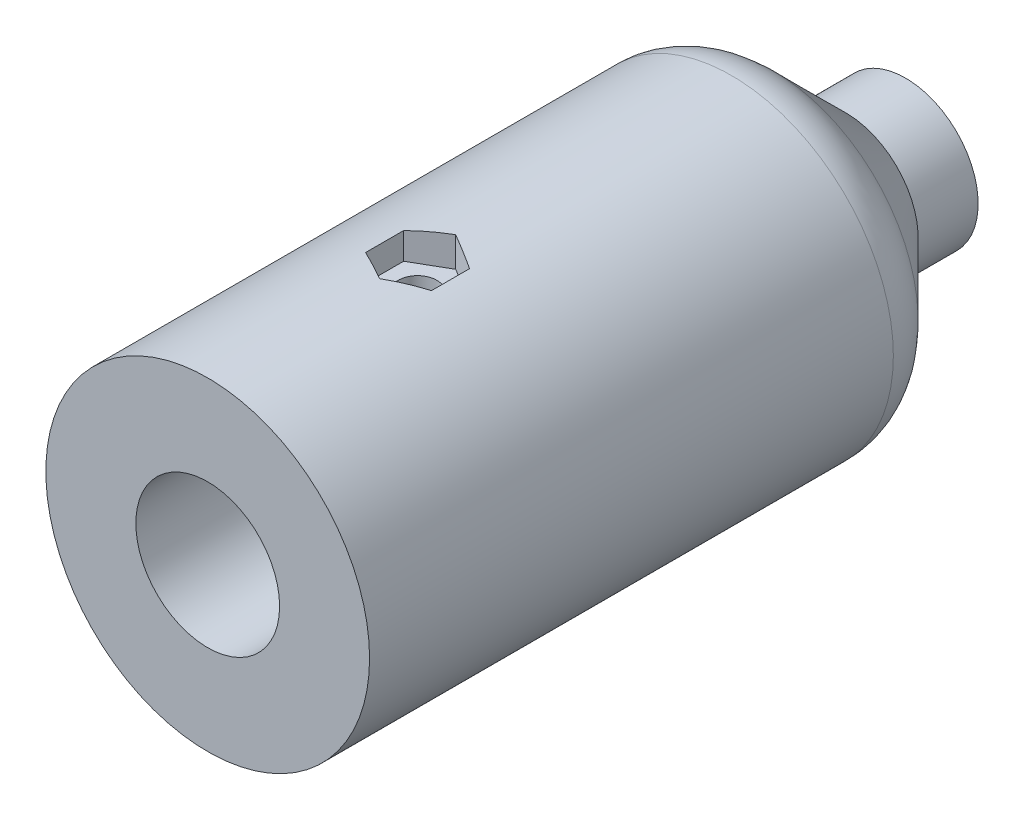
ISO-10303-21;
HEADER;
FILE_DESCRIPTION(('STEP AP214'),'2;1');
FILE_NAME('part.step','',(''),(''),'','','');
FILE_SCHEMA(('AUTOMOTIVE_DESIGN { 1 0 10303 214 1 1 1 1 }'));
ENDSEC;
DATA;
#1=APPLICATION_CONTEXT('core data for automotive mechanical design processes');
#2=APPLICATION_PROTOCOL_DEFINITION('international standard','automotive_design',2000,#1);
#3=PRODUCT_CONTEXT('',#1,'mechanical');
#4=PRODUCT('Part','Part','',(#3));
#5=PRODUCT_RELATED_PRODUCT_CATEGORY('part','',(#4));
#6=PRODUCT_DEFINITION_FORMATION('','',#4);
#7=PRODUCT_DEFINITION_CONTEXT('part definition',#1,'design');
#8=PRODUCT_DEFINITION('design','',#6,#7);
#9=PRODUCT_DEFINITION_SHAPE('','',#8);
#10=(LENGTH_UNIT() NAMED_UNIT(*) SI_UNIT(.MILLI.,.METRE.));
#11=(NAMED_UNIT(*) PLANE_ANGLE_UNIT() SI_UNIT($,.RADIAN.));
#12=(NAMED_UNIT(*) SI_UNIT($,.STERADIAN.) SOLID_ANGLE_UNIT());
#13=UNCERTAINTY_MEASURE_WITH_UNIT(LENGTH_MEASURE(1.E-05),#10,'distance_accuracy_value','');
#14=(GEOMETRIC_REPRESENTATION_CONTEXT(3) GLOBAL_UNCERTAINTY_ASSIGNED_CONTEXT((#13)) GLOBAL_UNIT_ASSIGNED_CONTEXT((#10,
#11,#12)) REPRESENTATION_CONTEXT('',''));
#15=CARTESIAN_POINT('',(0.,0.,0.));
#16=DIRECTION('',(0.,0.,1.));
#17=DIRECTION('',(1.,0.,0.));
#18=AXIS2_PLACEMENT_3D('',#15,#16,#17);
#19=CARTESIAN_POINT('',(0.,0.,-11.05));
#20=DIRECTION('',(0.,0.,1.));
#21=DIRECTION('',(1.,0.,0.));
#22=AXIS2_PLACEMENT_3D('',#19,#20,#21);
#23=CYLINDRICAL_SURFACE('',#22,13.5);
#24=CARTESIAN_POINT('',(0.,0.,4.52106781186549));
#25=DIRECTION('',(0.,0.,-1.));
#26=DIRECTION('',(-1.,0.,0.));
#27=AXIS2_PLACEMENT_3D('',#24,#25,#26);
#28=CIRCLE('',#27,13.5);
#29=CARTESIAN_POINT('',(-13.5,0.,4.52106781186549));
#30=VERTEX_POINT('',#29);
#31=EDGE_CURVE('E73',#30,#30,#28,.F.);
#32=ORIENTED_EDGE('',*,*,#31,.T.);
#33=EDGE_LOOP('',(#32));
#34=FACE_BOUND('',#33,.T.);
#35=CARTESIAN_POINT('',(0.,-13.5,33.45));
#36=CARTESIAN_POINT('',(-0.152776427921144,-13.4999971769599,33.4499944517676));
#37=CARTESIAN_POINT('',(-0.305622386157097,-13.4973800285345,33.4372257326495));
#38=CARTESIAN_POINT('',(-0.606989918720683,-13.4871922094026,33.3865311596364));
#39=CARTESIAN_POINT('',(-0.755508029342768,-13.4796176790417,33.3485857036456));
#40=CARTESIAN_POINT('',(-1.04381938705054,-13.4603604362313,33.2487617812005));
#41=CARTESIAN_POINT('',(-1.18362098312048,-13.4486817283599,33.1869066383386));
#42=CARTESIAN_POINT('',(-1.45085318025998,-13.4224839679877,33.0410894140454));
#43=CARTESIAN_POINT('',(-1.57828443705548,-13.4079650661628,32.9571285052713));
#44=CARTESIAN_POINT('',(-1.81895441528584,-13.3774558004972,32.7682352704008));
#45=CARTESIAN_POINT('',(-1.93199469903109,-13.3614492406223,32.6630527052597));
#46=CARTESIAN_POINT('',(-2.13895522160904,-13.3298858095393,32.4352397039523));
#47=CARTESIAN_POINT('',(-2.23287392848959,-13.3143289744471,32.3126078711494));
#48=CARTESIAN_POINT('',(-2.39977582887773,-13.2852679651617,32.0519423924096));
#49=CARTESIAN_POINT('',(-2.4725524437138,-13.2717846141375,31.9137739485517));
#50=CARTESIAN_POINT('',(-2.59378056474845,-13.2486277106913,31.6268497569824));
#51=CARTESIAN_POINT('',(-2.64223456933544,-13.2389537669935,31.4780950984669));
#52=CARTESIAN_POINT('',(-2.71279560040003,-13.2246750803094,31.1763595154767));
#53=CARTESIAN_POINT('',(-2.73525140615712,-13.2200032963911,31.0234633910747));
#54=CARTESIAN_POINT('',(-2.75426216373002,-13.2160561839857,30.7160079141797));
#55=CARTESIAN_POINT('',(-2.75081986524157,-13.2167802825982,30.5614487399987));
#56=CARTESIAN_POINT('',(-2.71841386837598,-13.2234822508663,30.2576140616789));
#57=CARTESIAN_POINT('',(-2.68985100745145,-13.2293776013332,30.1082937130338));
#58=CARTESIAN_POINT('',(-2.60864783385961,-13.2456277824189,29.8166096701382));
#59=CARTESIAN_POINT('',(-2.5560063326269,-13.2559828331753,29.6742463196817));
#60=CARTESIAN_POINT('',(-2.42776025922241,-13.2800694439878,29.3993677046943));
#61=CARTESIAN_POINT('',(-2.35199772147896,-13.2938241036426,29.2669282478996));
#62=CARTESIAN_POINT('',(-2.17977157653758,-13.323145427768,29.0164923722472));
#63=CARTESIAN_POINT('',(-2.08330550510322,-13.3387123078368,28.8984976753037));
#64=CARTESIAN_POINT('',(-1.87026911246385,-13.3702609169943,28.6779888001456));
#65=CARTESIAN_POINT('',(-1.75335691784843,-13.3862449636481,28.5758049558574));
#66=CARTESIAN_POINT('',(-1.50388066610741,-13.4165609216995,28.3924455790135));
#67=CARTESIAN_POINT('',(-1.37131639363404,-13.4308928103607,28.3112703355519));
#68=CARTESIAN_POINT('',(-1.09392514951882,-13.4563269065719,28.1721674318969));
#69=CARTESIAN_POINT('',(-0.949078187035954,-13.4674237133433,28.1142785864867));
#70=CARTESIAN_POINT('',(-0.65143817882934,-13.4850965282405,28.023749600173));
#71=CARTESIAN_POINT('',(-0.498646134925622,-13.4916731048566,27.9911062841818));
#72=CARTESIAN_POINT('',(-0.192290855098595,-13.4994849521774,27.9524650954842));
#73=CARTESIAN_POINT('',(-0.0387868584138547,-13.5008108012952,27.9460153172719));
#74=CARTESIAN_POINT('',(0.267105342411568,-13.4982238234868,27.9587257561482));
#75=CARTESIAN_POINT('',(0.419493611208024,-13.494311302576,27.9778844772379));
#76=CARTESIAN_POINT('',(0.717363197729971,-13.4817439728392,28.0408927474931));
#77=CARTESIAN_POINT('',(0.862895825974631,-13.4731339090149,28.0845094370501));
#78=CARTESIAN_POINT('',(1.14458145829174,-13.4521336840843,28.1949403040523));
#79=CARTESIAN_POINT('',(1.28073373932793,-13.4397432319848,28.2617562673032));
#80=CARTESIAN_POINT('',(1.5416925864592,-13.4123314152493,28.4176597330723));
#81=CARTESIAN_POINT('',(1.66633400590839,-13.3972787780333,28.5070180501576));
#82=CARTESIAN_POINT('',(1.89901500788807,-13.3662838850703,28.7051082159625));
#83=CARTESIAN_POINT('',(2.00705273658077,-13.3503415302547,28.8138422250973));
#84=CARTESIAN_POINT('',(2.20521187836328,-13.3190572268871,29.0496577337713));
#85=CARTESIAN_POINT('',(2.29502251850333,-13.3037287821263,29.1770024856556));
#86=CARTESIAN_POINT('',(2.45198046954391,-13.275698650571,29.4452353517825));
#87=CARTESIAN_POINT('',(2.51912870427313,-13.2629968567098,29.5861229136542));
#88=CARTESIAN_POINT('',(2.62843657934136,-13.2417682150959,29.8767213416989));
#89=CARTESIAN_POINT('',(2.67072822634444,-13.2332193550589,30.0263808686205));
#90=CARTESIAN_POINT('',(2.72952042949336,-13.2212191104971,30.3308754154677));
#91=CARTESIAN_POINT('',(2.74602449145786,-13.217767033069,30.4857097289579));
#92=CARTESIAN_POINT('',(2.75263951091989,-13.2163906866687,30.7930360469559));
#93=CARTESIAN_POINT('',(2.74324183991972,-13.2183635025496,30.9455172250479));
#94=CARTESIAN_POINT('',(2.6994073101927,-13.2273841762041,31.2466760776273));
#95=CARTESIAN_POINT('',(2.66497066952444,-13.2344319897808,31.3953537852265));
#96=CARTESIAN_POINT('',(2.57225848400871,-13.2527617255446,31.6843577756692));
#97=CARTESIAN_POINT('',(2.5140453536502,-13.2640325557458,31.8247048304222));
#98=CARTESIAN_POINT('',(2.37548994647098,-13.2895443138946,32.0937162125755));
#99=CARTESIAN_POINT('',(2.29514572606838,-13.3037855026763,32.2223795125727));
#100=CARTESIAN_POINT('',(2.11293981023068,-13.3339468270623,32.4668132410173));
#101=CARTESIAN_POINT('',(2.01072413518515,-13.3498921108282,32.5823167515072));
#102=CARTESIAN_POINT('',(1.78840516733545,-13.3814867636536,32.7946942547119));
#103=CARTESIAN_POINT('',(1.66829776668103,-13.3971360638246,32.8915639574644));
#104=CARTESIAN_POINT('',(1.41202612470544,-13.4265774434086,33.0649267555129));
#105=CARTESIAN_POINT('',(1.27570072821526,-13.4403473534443,33.141185557741));
#106=CARTESIAN_POINT('',(0.991925227527936,-13.4642595508069,33.2695900894426));
#107=CARTESIAN_POINT('',(0.84448515513844,-13.4744050630484,33.3217572673097));
#108=CARTESIAN_POINT('',(0.580622881074541,-13.4879848156679,33.3905471325646));
#109=CARTESIAN_POINT('',(0.465689330180749,-13.4924638514317,33.4128016861485));
#110=CARTESIAN_POINT('',(0.233850721641044,-13.4984724738658,33.4425299917581));
#111=CARTESIAN_POINT('',(0.116945731252775,-13.5000021609517,33.450004247004));
#112=CARTESIAN_POINT('',(0.,-13.5,33.45));
#113=B_SPLINE_CURVE_WITH_KNOTS('',3,(#35,#36,#37,#38,#39,#40,#41,#42,#43,#44,#45,#46,#47,#48,
#49,#50,#51,#52,#53,#54,#55,#56,#57,#58,#59,#60,#61,#62,#63,#64,#65,#66,#67,#68,#69,#70,#71,#72,
#73,#74,#75,#76,#77,#78,#79,#80,#81,#82,#83,#84,#85,#86,#87,#88,#89,#90,#91,#92,#93,#94,#95,#96,
#97,#98,#99,#100,#101,#102,#103,#104,#105,#106,#107,#108,#109,#110,#111,#112),.UNSPECIFIED.,.T.,
.F.,(4,2,2,2,2,2,2,2,2,2,2,2,2,2,2,2,2,2,2,2,2,2,2,2,2,2,2,2,2,2,2,2,2,2,2,2,2,2,4),(0.,
0.457901415191654,0.916159762127019,1.37397220747875,1.83176037187898,2.29530037440864,
2.75887749949944,3.22684259056603,3.69475960299622,4.15632374123228,4.61783887421981,
5.0721207709991,5.52642509437785,5.98390553179446,6.44144045101105,6.90752176557039,
7.3736094934164,7.84047092903916,8.3072736387298,8.76598768743038,9.22467494011729,
9.67906750733192,10.1334950599872,10.59366607949,11.0538884408084,11.5213979472355,
11.988888393423,12.4538731497629,12.9187946859866,13.3749573988852,13.8311161392162,
14.2860850580125,14.7410939455327,15.204114872189,15.6672422704403,16.1354317380176,
16.6032035765054,16.953725184125,17.3042348574426),.UNSPECIFIED.);
#114=CARTESIAN_POINT('',(0.,-13.5,33.45));
#115=VERTEX_POINT('',#114);
#116=EDGE_CURVE('E212',#115,#115,#113,.T.);
#117=ORIENTED_EDGE('',*,*,#116,.F.);
#118=EDGE_LOOP('',(#117));
#119=FACE_BOUND('',#118,.T.);
#120=DIRECTION('',(0.,0.,1.));
#121=VECTOR('',#120,1.);
#122=CARTESIAN_POINT('',(2.74999999999999,13.2169398878863,-11.05));
#123=LINE('',#122,#121);
#124=CARTESIAN_POINT('',(2.75,13.2169398878863,29.1122867597285));
#125=VERTEX_POINT('',#124);
#126=CARTESIAN_POINT('',(2.75,13.2169398878863,32.2877132402715));
#127=VERTEX_POINT('',#126);
#128=EDGE_CURVE('E206',#125,#127,#123,.T.);
#129=ORIENTED_EDGE('',*,*,#128,.T.);
#130=CARTESIAN_POINT('',(0.,0.,33.8754264805429));
#131=DIRECTION('',(-0.5,0.,-0.866025403784439));
#132=DIRECTION('',(-0.866025403784439,0.,0.5));
#133=AXIS2_PLACEMENT_3D('',#130,#131,#132);
#134=ELLIPSE('',#133,15.5884572681199,13.5);
#135=CARTESIAN_POINT('',(0.,13.5,33.8754264805429));
#136=VERTEX_POINT('',#135);
#137=EDGE_CURVE('E209',#127,#136,#134,.F.);
#138=ORIENTED_EDGE('',*,*,#137,.T.);
#139=CARTESIAN_POINT('',(0.,0.,33.8754264805429));
#140=DIRECTION('',(0.5,0.,-0.866025403784439));
#141=DIRECTION('',(0.866025403784439,0.,0.5));
#142=AXIS2_PLACEMENT_3D('',#139,#140,#141);
#143=ELLIPSE('',#142,15.5884572681199,13.5);
#144=CARTESIAN_POINT('',(-2.75,13.2169398878863,32.2877132402715));
#145=VERTEX_POINT('',#144);
#146=EDGE_CURVE('E200',#136,#145,#143,.F.);
#147=ORIENTED_EDGE('',*,*,#146,.T.);
#148=DIRECTION('',(0.,0.,1.));
#149=VECTOR('',#148,1.);
#150=CARTESIAN_POINT('',(-2.75,13.2169398878863,-11.05));
#151=LINE('',#150,#149);
#152=CARTESIAN_POINT('',(-2.75,13.2169398878863,29.1122867597285));
#153=VERTEX_POINT('',#152);
#154=EDGE_CURVE('E197',#145,#153,#151,.F.);
#155=ORIENTED_EDGE('',*,*,#154,.T.);
#156=CARTESIAN_POINT('',(0.,0.,27.524573519457));
#157=DIRECTION('',(0.499999999999999,0.,0.866025403784439));
#158=DIRECTION('',(-0.866025403784439,0.,0.499999999999999));
#159=AXIS2_PLACEMENT_3D('',#156,#157,#158);
#160=ELLIPSE('',#159,15.5884572681199,13.5);
#161=CARTESIAN_POINT('',(0.,13.5,27.5245735194571));
#162=VERTEX_POINT('',#161);
#163=EDGE_CURVE('E185',#153,#162,#160,.F.);
#164=ORIENTED_EDGE('',*,*,#163,.T.);
#165=CARTESIAN_POINT('',(0.,0.,27.5245735194571));
#166=DIRECTION('',(-0.5,0.,0.866025403784439));
#167=DIRECTION('',(0.866025403784439,0.,0.5));
#168=AXIS2_PLACEMENT_3D('',#165,#166,#167);
#169=ELLIPSE('',#168,15.5884572681199,13.5);
#170=EDGE_CURVE('E203',#162,#125,#169,.F.);
#171=ORIENTED_EDGE('',*,*,#170,.T.);
#172=EDGE_LOOP('',(#129,#138,#147,#155,#164,#171));
#173=FACE_BOUND('',#172,.T.);
#174=CARTESIAN_POINT('',(0.,0.,48.2));
#175=DIRECTION('',(0.,0.,1.));
#176=DIRECTION('',(1.,0.,0.));
#177=AXIS2_PLACEMENT_3D('',#174,#175,#176);
#178=CIRCLE('',#177,13.5);
#179=CARTESIAN_POINT('',(13.5,0.,48.2));
#180=VERTEX_POINT('',#179);
#181=EDGE_CURVE('E321',#180,#180,#178,.T.);
#182=ORIENTED_EDGE('',*,*,#181,.F.);
#183=EDGE_LOOP('',(#182));
#184=FACE_BOUND('',#183,.T.);
#185=ADVANCED_FACE('F65',(#34,#119,#173,#184),#23,.T.);
#186=CARTESIAN_POINT('',(0.,-13.5,30.7));
#187=DIRECTION('',(0.,1.,0.));
#188=DIRECTION('',(0.,0.,1.));
#189=AXIS2_PLACEMENT_3D('',#186,#187,#188);
#190=CYLINDRICAL_SURFACE('',#189,1.6);
#191=CARTESIAN_POINT('',(0.,5.995,32.3));
#192=CARTESIAN_POINT('',(0.0882009311312173,5.99499867317882,32.2999979121356));
#193=CARTESIAN_POINT('',(0.17642422822399,5.99303437544826,32.2926823602428));
#194=CARTESIAN_POINT('',(0.350329191213314,5.98538917892863,32.2636653458322));
#195=CARTESIAN_POINT('',(0.436009616316777,5.97970649593981,32.241956977116));
#196=CARTESIAN_POINT('',(0.602293459574496,5.96525171755918,32.1849105017096));
#197=CARTESIAN_POINT('',(0.68290327411591,5.95648361033672,32.1495899842784));
#198=CARTESIAN_POINT('',(0.837055008795305,5.93678451998636,32.0663870785984));
#199=CARTESIAN_POINT('',(0.91059645435456,5.92585339178114,32.0185038476779));
#200=CARTESIAN_POINT('',(1.05023162799301,5.90272452859954,31.9103608274746));
#201=CARTESIAN_POINT('',(1.11613783340779,5.89050511625252,31.8498635387372));
#202=CARTESIAN_POINT('',(1.23699980546535,5.86631602111606,31.7187173919366));
#203=CARTESIAN_POINT('',(1.29195415988865,5.85434637071087,31.6480672266991));
#204=CARTESIAN_POINT('',(1.39026728230258,5.83179025195281,31.4971234252965));
#205=CARTESIAN_POINT('',(1.43341023554609,5.82123113046806,31.4166847621637));
#206=CARTESIAN_POINT('',(1.50548578538349,5.80301035825185,31.2493682302588));
#207=CARTESIAN_POINT('',(1.5344210070937,5.79534817232325,31.1624915544342));
#208=CARTESIAN_POINT('',(1.57660831099613,5.78401263108547,30.9868420637415));
#209=CARTESIAN_POINT('',(1.59020041749614,5.78025294943169,30.89815662238));
#210=CARTESIAN_POINT('',(1.60237574331264,5.77689018820743,30.7196907062715));
#211=CARTESIAN_POINT('',(1.60096177211328,5.7772863305706,30.6299104396451));
#212=CARTESIAN_POINT('',(1.58343500745315,5.78211320182607,30.4544581223643));
#213=CARTESIAN_POINT('',(1.56773375096901,5.78643096428167,30.368741359081));
#214=CARTESIAN_POINT('',(1.52273728304157,5.798433679011,30.2012051557525));
#215=CARTESIAN_POINT('',(1.49344098351737,5.80611890079699,30.119386028233));
#216=CARTESIAN_POINT('',(1.42175089781012,5.82408988070221,29.9608953346289));
#217=CARTESIAN_POINT('',(1.37921290451351,5.83440403308756,29.884292353294));
#218=CARTESIAN_POINT('',(1.28234753170942,5.85645547525972,29.7391671755749));
#219=CARTESIAN_POINT('',(1.22801782801047,5.8681930454061,29.6706465763748));
#220=CARTESIAN_POINT('',(1.10700742359416,5.89223893913815,29.5412800528222));
#221=CARTESIAN_POINT('',(1.03998116386168,5.90455338050777,29.4807580487995));
#222=CARTESIAN_POINT('',(0.896580071928184,5.92802159624772,29.3717469894699));
#223=CARTESIAN_POINT('',(0.820204870253476,5.93917532471399,29.3232584099579));
#224=CARTESIAN_POINT('',(0.659771724709064,5.95913419077858,29.2395476572897));
#225=CARTESIAN_POINT('',(0.575681767093099,5.9679288873493,29.2043841866504));
#226=CARTESIAN_POINT('',(0.402495569505118,5.9821032927168,29.148786461377));
#227=CARTESIAN_POINT('',(0.313400429978754,5.98748374899899,29.1283489826238));
#228=CARTESIAN_POINT('',(0.135497286019495,5.99411036863877,29.103292179707));
#229=CARTESIAN_POINT('',(0.0467555006320438,5.99547160106602,29.0982324672473));
#230=CARTESIAN_POINT('',(-0.130308671227461,5.99423727230249,29.1028585206019));
#231=CARTESIAN_POINT('',(-0.218631100176095,5.99164212081684,29.1125427595995));
#232=CARTESIAN_POINT('',(-0.390777028997673,5.98286094666919,29.1460206336209));
#233=CARTESIAN_POINT('',(-0.474651797403314,5.97673749573674,29.1695685611624));
#234=CARTESIAN_POINT('',(-0.637252366454864,5.96159442848247,29.2298199793335));
#235=CARTESIAN_POINT('',(-0.715977607565144,5.95257449806308,29.2665248967723));
#236=CARTESIAN_POINT('',(-0.867755000663512,5.93236948427773,29.3528647521344));
#237=CARTESIAN_POINT('',(-0.940665602339168,5.92114540529718,29.4027391683202));
#238=CARTESIAN_POINT('',(-1.07723723889796,5.89782951335151,29.5137012643477));
#239=CARTESIAN_POINT('',(-1.14089643913312,5.88573752898016,29.5747911629131));
#240=CARTESIAN_POINT('',(-1.25901445940207,5.8616251914969,29.7085053277676));
#241=CARTESIAN_POINT('',(-1.31316255061806,5.84961651295647,29.7814066952659));
#242=CARTESIAN_POINT('',(-1.40846343798014,5.82740588066731,29.9355151787037));
#243=CARTESIAN_POINT('',(-1.44961677555626,5.81720385165181,30.0167219484097));
#244=CARTESIAN_POINT('',(-1.51745031159584,5.79987895113432,30.1847317613408));
#245=CARTESIAN_POINT('',(-1.54421421669802,5.79273832111226,30.271499077955));
#246=CARTESIAN_POINT('',(-1.58270658373837,5.78234121827934,30.4485256944194));
#247=CARTESIAN_POINT('',(-1.59443889583742,5.77908375085818,30.5387840939667));
#248=CARTESIAN_POINT('',(-1.60231331560927,5.77690497611476,30.7170492273819));
#249=CARTESIAN_POINT('',(-1.59895489297795,5.77784474334197,30.8050325305628));
#250=CARTESIAN_POINT('',(-1.57790198422086,5.78362922898375,30.9791293908038));
#251=CARTESIAN_POINT('',(-1.56020786817552,5.78847384659336,31.0652429960717));
#252=CARTESIAN_POINT('',(-1.51127563262582,5.80143940841345,31.2325261962096));
#253=CARTESIAN_POINT('',(-1.48014351584126,5.80953467643337,31.3137289281548));
#254=CARTESIAN_POINT('',(-1.40530135043208,5.82808999221794,31.4698201040866));
#255=CARTESIAN_POINT('',(-1.36158932580051,5.83855041143671,31.5447075536999));
#256=CARTESIAN_POINT('',(-1.26131509487244,5.86104249582564,31.6884260647396));
#257=CARTESIAN_POINT('',(-1.20441213224093,5.87311138322004,31.7570135810767));
#258=CARTESIAN_POINT('',(-1.08001912953457,5.89725283402995,31.8838286291276));
#259=CARTESIAN_POINT('',(-1.01252651784664,5.90932539762559,31.9420536370382));
#260=CARTESIAN_POINT('',(-0.867124141732705,5.93242343993464,32.0477179732475));
#261=CARTESIAN_POINT('',(-0.78902206810318,5.94342092178502,32.0948993096953));
#262=CARTESIAN_POINT('',(-0.625703962839209,5.96282325045673,32.1753881793273));
#263=CARTESIAN_POINT('',(-0.540492530242833,5.97122975710481,32.2087045994459));
#264=CARTESIAN_POINT('',(-0.379666973107866,5.98341812044031,32.2561810999783));
#265=CARTESIAN_POINT('',(-0.304744826990898,5.98772964751631,32.2725749799835));
#266=CARTESIAN_POINT('',(-0.153220634953612,5.9935210232652,32.2944847977789));
#267=CARTESIAN_POINT('',(-0.0766187562911916,5.99500115258861,32.3000018136948));
#268=CARTESIAN_POINT('',(0.,5.995,32.3));
#269=B_SPLINE_CURVE_WITH_KNOTS('',3,(#191,#192,#193,#194,#195,#196,#197,#198,#199,#200,#201,
#202,#203,#204,#205,#206,#207,#208,#209,#210,#211,#212,#213,#214,#215,#216,#217,#218,#219,#220,
#221,#222,#223,#224,#225,#226,#227,#228,#229,#230,#231,#232,#233,#234,#235,#236,#237,#238,#239,
#240,#241,#242,#243,#244,#245,#246,#247,#248,#249,#250,#251,#252,#253,#254,#255,#256,#257,#258,
#259,#260,#261,#262,#263,#264,#265,#266,#267,#268),.UNSPECIFIED.,.T.,.F.,(4,2,2,2,2,2,2,2,2,2,2,
2,2,2,2,2,2,2,2,2,2,2,2,2,2,2,2,2,2,2,2,2,2,2,2,2,2,2,4),(0.,0.264321809660573,0.52877054244699,
0.792878701138482,1.05700457999774,1.32664420530651,1.59631857764562,1.87063360801213,
2.14489793499314,2.41295693722292,2.68096575350503,2.94149097234365,3.2020370459466,
3.46552616630356,3.72906726862027,4.00121944473235,4.27338237987542,4.54673073733037,
4.82001922950163,5.08540383596019,5.35076096226274,5.6115509900175,5.8723693076979,
6.13830307871491,6.40428951537718,6.67779036103861,6.95127980970714,7.22316060410303,
7.49497174558827,7.75785403629649,8.02072954083199,8.2815682559654,8.54244796509492,
8.81101642239197,9.07965020066121,9.35404313079647,9.62825991260712,9.85789485813741,
10.0875070408784),.UNSPECIFIED.);
#270=CARTESIAN_POINT('',(0.,5.995,32.3));
#271=VERTEX_POINT('',#270);
#272=EDGE_CURVE('E193',#271,#271,#269,.T.);
#273=ORIENTED_EDGE('',*,*,#272,.F.);
#274=EDGE_LOOP('',(#273));
#275=FACE_BOUND('',#274,.T.);
#276=CARTESIAN_POINT('',(0.,11.,30.7));
#277=DIRECTION('',(0.,1.,0.));
#278=DIRECTION('',(0.,0.,1.));
#279=AXIS2_PLACEMENT_3D('',#276,#277,#278);
#280=CIRCLE('',#279,1.6);
#281=CARTESIAN_POINT('',(0.,11.,32.3));
#282=VERTEX_POINT('',#281);
#283=EDGE_CURVE('E190',#282,#282,#280,.F.);
#284=ORIENTED_EDGE('',*,*,#283,.F.);
#285=EDGE_LOOP('',(#284));
#286=FACE_BOUND('',#285,.T.);
#287=ADVANCED_FACE('F266',(#275,#286),#190,.F.);
#288=CARTESIAN_POINT('',(0.,0.,-15.));
#289=DIRECTION('',(0.,0.,1.));
#290=DIRECTION('',(1.,0.,0.));
#291=AXIS2_PLACEMENT_3D('',#288,#289,#290);
#292=CYLINDRICAL_SURFACE('',#291,6.05);
#293=CARTESIAN_POINT('',(0.,0.,-5.));
#294=DIRECTION('',(0.,0.,-1.));
#295=DIRECTION('',(-1.,0.,0.));
#296=AXIS2_PLACEMENT_3D('',#293,#294,#295);
#297=CIRCLE('',#296,6.05);
#298=CARTESIAN_POINT('',(-6.05,0.,-5.));
#299=VERTEX_POINT('',#298);
#300=EDGE_CURVE('E182',#299,#299,#297,.F.);
#301=ORIENTED_EDGE('',*,*,#300,.F.);
#302=EDGE_LOOP('',(#301));
#303=FACE_BOUND('',#302,.T.);
#304=CARTESIAN_POINT('',(0.,0.,-10.));
#305=DIRECTION('',(0.,0.,-1.));
#306=DIRECTION('',(-1.,0.,0.));
#307=AXIS2_PLACEMENT_3D('',#304,#305,#306);
#308=CIRCLE('',#307,6.05);
#309=CARTESIAN_POINT('',(-6.05,0.,-10.));
#310=VERTEX_POINT('',#309);
#311=EDGE_CURVE('E189',#310,#310,#308,.T.);
#312=ORIENTED_EDGE('',*,*,#311,.F.);
#313=EDGE_LOOP('',(#312));
#314=FACE_BOUND('',#313,.T.);
#315=ADVANCED_FACE('F291',(#303,#314),#292,.T.);
#316=CARTESIAN_POINT('',(0.,0.,38.2));
#317=DIRECTION('',(0.,0.,-1.));
#318=DIRECTION('',(-1.,0.,0.));
#319=AXIS2_PLACEMENT_3D('',#316,#317,#318);
#320=CYLINDRICAL_SURFACE('',#319,2.1);
#321=CARTESIAN_POINT('',(0.,0.,-10.));
#322=DIRECTION('',(0.,0.,-1.));
#323=DIRECTION('',(-1.,0.,0.));
#324=AXIS2_PLACEMENT_3D('',#321,#322,#323);
#325=CIRCLE('',#324,2.1);
#326=CARTESIAN_POINT('',(-2.1,0.,-10.));
#327=VERTEX_POINT('',#326);
#328=EDGE_CURVE('E178',#327,#327,#325,.F.);
#329=ORIENTED_EDGE('',*,*,#328,.F.);
#330=EDGE_LOOP('',(#329));
#331=FACE_BOUND('',#330,.T.);
#332=CARTESIAN_POINT('',(0.,0.,16.95));
#333=DIRECTION('',(0.,0.,1.));
#334=DIRECTION('',(1.,0.,0.));
#335=AXIS2_PLACEMENT_3D('',#332,#333,#334);
#336=CIRCLE('',#335,2.1);
#337=CARTESIAN_POINT('',(2.1,0.,16.95));
#338=VERTEX_POINT('',#337);
#339=EDGE_CURVE('E392',#338,#338,#336,.T.);
#340=ORIENTED_EDGE('',*,*,#339,.T.);
#341=EDGE_LOOP('',(#340));
#342=FACE_BOUND('',#341,.T.);
#343=ADVANCED_FACE('F294',(#331,#342),#320,.F.);
#344=CARTESIAN_POINT('',(0.,0.,-5.));
#345=DIRECTION('',(0.,0.,1.));
#346=DIRECTION('',(1.,0.,0.));
#347=AXIS2_PLACEMENT_3D('',#344,#345,#346);
#348=CONICAL_SURFACE('',#347,6.05000000000001,0.785398163397447);
#349=CARTESIAN_POINT('',(0.,0.,0.98553390593276));
#350=DIRECTION('',(0.,0.,-1.));
#351=DIRECTION('',(-1.,0.,0.));
#352=AXIS2_PLACEMENT_3D('',#349,#350,#351);
#353=CIRCLE('',#352,12.0355339059327);
#354=CARTESIAN_POINT('',(-12.0355339059327,0.,0.98553390593276));
#355=VERTEX_POINT('',#354);
#356=EDGE_CURVE('E12',#355,#355,#353,.T.);
#357=ORIENTED_EDGE('',*,*,#356,.T.);
#358=EDGE_LOOP('',(#357));
#359=FACE_BOUND('',#358,.T.);
#360=ORIENTED_EDGE('',*,*,#300,.T.);
#361=EDGE_LOOP('',(#360));
#362=FACE_BOUND('',#361,.T.);
#363=ADVANCED_FACE('F288',(#359,#362),#348,.T.);
#364=CARTESIAN_POINT('',(0.,0.,0.));
#365=DIRECTION('',(0.,0.,1.));
#366=DIRECTION('',(1.,0.,0.));
#367=AXIS2_PLACEMENT_3D('',#364,#365,#366);
#368=CYLINDRICAL_SURFACE('',#367,5.995);
#369=CARTESIAN_POINT('',(0.,0.,20.));
#370=DIRECTION('',(0.,0.,1.));
#371=DIRECTION('',(1.,0.,0.));
#372=AXIS2_PLACEMENT_3D('',#369,#370,#371);
#373=CIRCLE('',#372,5.995);
#374=CARTESIAN_POINT('',(5.995,0.,20.));
#375=VERTEX_POINT('',#374);
#376=EDGE_CURVE('E328',#375,#375,#373,.T.);
#377=ORIENTED_EDGE('',*,*,#376,.F.);
#378=EDGE_LOOP('',(#377));
#379=FACE_BOUND('',#378,.T.);
#380=CARTESIAN_POINT('',(0.,-5.995,32.3));
#381=CARTESIAN_POINT('',(-0.0882009311312173,-5.99499867317882,32.2999979121356));
#382=CARTESIAN_POINT('',(-0.17642422822399,-5.99303437544826,32.2926823602428));
#383=CARTESIAN_POINT('',(-0.350329191213314,-5.98538917892863,32.2636653458322));
#384=CARTESIAN_POINT('',(-0.436009616316777,-5.97970649593981,32.241956977116));
#385=CARTESIAN_POINT('',(-0.602293459574496,-5.96525171755918,32.1849105017096));
#386=CARTESIAN_POINT('',(-0.68290327411591,-5.95648361033672,32.1495899842784));
#387=CARTESIAN_POINT('',(-0.837055008795305,-5.93678451998636,32.0663870785984));
#388=CARTESIAN_POINT('',(-0.91059645435456,-5.92585339178114,32.0185038476779));
#389=CARTESIAN_POINT('',(-1.05023162799301,-5.90272452859954,31.9103608274746));
#390=CARTESIAN_POINT('',(-1.11613783340779,-5.89050511625252,31.8498635387372));
#391=CARTESIAN_POINT('',(-1.23699980546535,-5.86631602111606,31.7187173919366));
#392=CARTESIAN_POINT('',(-1.29195415988865,-5.85434637071087,31.6480672266991));
#393=CARTESIAN_POINT('',(-1.39026728230258,-5.83179025195281,31.4971234252965));
#394=CARTESIAN_POINT('',(-1.43341023554609,-5.82123113046806,31.4166847621637));
#395=CARTESIAN_POINT('',(-1.50548578538349,-5.80301035825185,31.2493682302588));
#396=CARTESIAN_POINT('',(-1.5344210070937,-5.79534817232325,31.1624915544342));
#397=CARTESIAN_POINT('',(-1.57660831099613,-5.78401263108547,30.9868420637415));
#398=CARTESIAN_POINT('',(-1.59020041749614,-5.78025294943169,30.89815662238));
#399=CARTESIAN_POINT('',(-1.60237574331264,-5.77689018820743,30.7196907062715));
#400=CARTESIAN_POINT('',(-1.60096177211328,-5.7772863305706,30.6299104396451));
#401=CARTESIAN_POINT('',(-1.58343500745315,-5.78211320182607,30.4544581223643));
#402=CARTESIAN_POINT('',(-1.56773375096901,-5.78643096428167,30.368741359081));
#403=CARTESIAN_POINT('',(-1.52273728304157,-5.798433679011,30.2012051557525));
#404=CARTESIAN_POINT('',(-1.49344098351737,-5.80611890079699,30.119386028233));
#405=CARTESIAN_POINT('',(-1.42175089781012,-5.82408988070221,29.9608953346289));
#406=CARTESIAN_POINT('',(-1.37921290451351,-5.83440403308756,29.884292353294));
#407=CARTESIAN_POINT('',(-1.28234753170942,-5.85645547525972,29.7391671755749));
#408=CARTESIAN_POINT('',(-1.22801782801047,-5.8681930454061,29.6706465763748));
#409=CARTESIAN_POINT('',(-1.10700742359416,-5.89223893913815,29.5412800528222));
#410=CARTESIAN_POINT('',(-1.03998116386168,-5.90455338050777,29.4807580487995));
#411=CARTESIAN_POINT('',(-0.896580071928184,-5.92802159624772,29.3717469894699));
#412=CARTESIAN_POINT('',(-0.820204870253476,-5.93917532471399,29.3232584099579));
#413=CARTESIAN_POINT('',(-0.659771724709064,-5.95913419077858,29.2395476572897));
#414=CARTESIAN_POINT('',(-0.575681767093099,-5.9679288873493,29.2043841866504));
#415=CARTESIAN_POINT('',(-0.402495569505118,-5.9821032927168,29.148786461377));
#416=CARTESIAN_POINT('',(-0.313400429978754,-5.98748374899899,29.1283489826238));
#417=CARTESIAN_POINT('',(-0.135497286019495,-5.99411036863877,29.103292179707));
#418=CARTESIAN_POINT('',(-0.0467555006320438,-5.99547160106602,29.0982324672473));
#419=CARTESIAN_POINT('',(0.130308671227461,-5.99423727230249,29.1028585206019));
#420=CARTESIAN_POINT('',(0.218631100176095,-5.99164212081684,29.1125427595995));
#421=CARTESIAN_POINT('',(0.390777028997673,-5.98286094666919,29.1460206336209));
#422=CARTESIAN_POINT('',(0.474651797403314,-5.97673749573674,29.1695685611624));
#423=CARTESIAN_POINT('',(0.637252366454864,-5.96159442848247,29.2298199793335));
#424=CARTESIAN_POINT('',(0.715977607565144,-5.95257449806308,29.2665248967723));
#425=CARTESIAN_POINT('',(0.867755000663512,-5.93236948427773,29.3528647521344));
#426=CARTESIAN_POINT('',(0.940665602339168,-5.92114540529718,29.4027391683202));
#427=CARTESIAN_POINT('',(1.07723723889796,-5.89782951335151,29.5137012643477));
#428=CARTESIAN_POINT('',(1.14089643913312,-5.88573752898016,29.5747911629131));
#429=CARTESIAN_POINT('',(1.25901445940207,-5.8616251914969,29.7085053277676));
#430=CARTESIAN_POINT('',(1.31316255061806,-5.84961651295647,29.7814066952659));
#431=CARTESIAN_POINT('',(1.40846343798014,-5.82740588066731,29.9355151787037));
#432=CARTESIAN_POINT('',(1.44961677555626,-5.81720385165181,30.0167219484097));
#433=CARTESIAN_POINT('',(1.51745031159584,-5.79987895113432,30.1847317613408));
#434=CARTESIAN_POINT('',(1.54421421669802,-5.79273832111226,30.271499077955));
#435=CARTESIAN_POINT('',(1.58270658373837,-5.78234121827934,30.4485256944194));
#436=CARTESIAN_POINT('',(1.59443889583742,-5.77908375085818,30.5387840939667));
#437=CARTESIAN_POINT('',(1.60231331560927,-5.77690497611476,30.7170492273819));
#438=CARTESIAN_POINT('',(1.59895489297795,-5.77784474334197,30.8050325305628));
#439=CARTESIAN_POINT('',(1.57790198422086,-5.78362922898375,30.9791293908038));
#440=CARTESIAN_POINT('',(1.56020786817552,-5.78847384659336,31.0652429960717));
#441=CARTESIAN_POINT('',(1.51127563262582,-5.80143940841345,31.2325261962096));
#442=CARTESIAN_POINT('',(1.48014351584126,-5.80953467643337,31.3137289281548));
#443=CARTESIAN_POINT('',(1.40530135043208,-5.82808999221794,31.4698201040866));
#444=CARTESIAN_POINT('',(1.36158932580051,-5.83855041143671,31.5447075536999));
#445=CARTESIAN_POINT('',(1.26131509487244,-5.86104249582564,31.6884260647396));
#446=CARTESIAN_POINT('',(1.20441213224093,-5.87311138322004,31.7570135810767));
#447=CARTESIAN_POINT('',(1.08001912953457,-5.89725283402995,31.8838286291276));
#448=CARTESIAN_POINT('',(1.01252651784664,-5.90932539762559,31.9420536370382));
#449=CARTESIAN_POINT('',(0.867124141732705,-5.93242343993464,32.0477179732475));
#450=CARTESIAN_POINT('',(0.78902206810318,-5.94342092178502,32.0948993096953));
#451=CARTESIAN_POINT('',(0.625703962839209,-5.96282325045673,32.1753881793273));
#452=CARTESIAN_POINT('',(0.540492530242833,-5.97122975710481,32.2087045994459));
#453=CARTESIAN_POINT('',(0.379666973107866,-5.98341812044031,32.2561810999783));
#454=CARTESIAN_POINT('',(0.304744826990898,-5.98772964751631,32.2725749799835));
#455=CARTESIAN_POINT('',(0.153220634953612,-5.9935210232652,32.2944847977789));
#456=CARTESIAN_POINT('',(0.0766187562911916,-5.99500115258861,32.3000018136948));
#457=CARTESIAN_POINT('',(0.,-5.995,32.3));
#458=B_SPLINE_CURVE_WITH_KNOTS('',3,(#380,#381,#382,#383,#384,#385,#386,#387,#388,#389,#390,
#391,#392,#393,#394,#395,#396,#397,#398,#399,#400,#401,#402,#403,#404,#405,#406,#407,#408,#409,
#410,#411,#412,#413,#414,#415,#416,#417,#418,#419,#420,#421,#422,#423,#424,#425,#426,#427,#428,
#429,#430,#431,#432,#433,#434,#435,#436,#437,#438,#439,#440,#441,#442,#443,#444,#445,#446,#447,
#448,#449,#450,#451,#452,#453,#454,#455,#456,#457),.UNSPECIFIED.,.T.,.F.,(4,2,2,2,2,2,2,2,2,2,2,
2,2,2,2,2,2,2,2,2,2,2,2,2,2,2,2,2,2,2,2,2,2,2,2,2,2,2,4),(0.,0.264321809660573,0.52877054244699,
0.792878701138482,1.05700457999774,1.32664420530651,1.59631857764562,1.87063360801213,
2.14489793499314,2.41295693722292,2.68096575350503,2.94149097234365,3.2020370459466,
3.46552616630356,3.72906726862027,4.00121944473235,4.27338237987542,4.54673073733037,
4.82001922950163,5.08540383596019,5.35076096226274,5.6115509900175,5.8723693076979,
6.13830307871491,6.40428951537718,6.67779036103861,6.95127980970714,7.22316060410303,
7.49497174558827,7.75785403629649,8.02072954083199,8.2815682559654,8.54244796509492,
8.81101642239197,9.07965020066121,9.35404313079647,9.62825991260712,9.85789485813741,
10.0875070408784),.UNSPECIFIED.);
#459=CARTESIAN_POINT('',(0.,-5.995,32.3));
#460=VERTEX_POINT('',#459);
#461=EDGE_CURVE('E269',#460,#460,#458,.T.);
#462=ORIENTED_EDGE('',*,*,#461,.T.);
#463=EDGE_LOOP('',(#462));
#464=FACE_BOUND('',#463,.T.);
#465=ORIENTED_EDGE('',*,*,#272,.T.);
#466=EDGE_LOOP('',(#465));
#467=FACE_BOUND('',#466,.T.);
#468=CARTESIAN_POINT('',(0.,0.,48.2));
#469=DIRECTION('',(0.,0.,1.));
#470=DIRECTION('',(1.,0.,0.));
#471=AXIS2_PLACEMENT_3D('',#468,#469,#470);
#472=CIRCLE('',#471,5.995);
#473=CARTESIAN_POINT('',(5.995,0.,48.2));
#474=VERTEX_POINT('',#473);
#475=EDGE_CURVE('E323',#474,#474,#472,.T.);
#476=ORIENTED_EDGE('',*,*,#475,.T.);
#477=EDGE_LOOP('',(#476));
#478=FACE_BOUND('',#477,.T.);
#479=ADVANCED_FACE('F282',(#379,#464,#467,#478),#368,.F.);
#480=CARTESIAN_POINT('',(3.5,2.02072594216369,15.7));
#481=DIRECTION('',(0.5,0.866025403784439,0.));
#482=DIRECTION('',(-0.866025403784439,0.5,0.));
#483=AXIS2_PLACEMENT_3D('',#480,#481,#482);
#484=PLANE('',#483);
#485=DIRECTION('',(0.,0.,1.));
#486=VECTOR('',#485,1.);
#487=CARTESIAN_POINT('',(0.,4.04145188432738,15.7));
#488=LINE('',#487,#486);
#489=CARTESIAN_POINT('',(0.,4.04145188432738,16.95));
#490=VERTEX_POINT('',#489);
#491=CARTESIAN_POINT('',(0.,4.04145188432738,20.));
#492=VERTEX_POINT('',#491);
#493=EDGE_CURVE('E174',#490,#492,#488,.T.);
#494=ORIENTED_EDGE('',*,*,#493,.F.);
#495=DIRECTION('',(-0.866025403784441,0.499999999999995,0.));
#496=VECTOR('',#495,1.);
#497=CARTESIAN_POINT('',(3.49999999999998,2.02072594216373,16.95));
#498=LINE('',#497,#496);
#499=CARTESIAN_POINT('',(3.49999999999998,2.02072594216373,16.95));
#500=VERTEX_POINT('',#499);
#501=EDGE_CURVE('E80',#500,#490,#498,.T.);
#502=ORIENTED_EDGE('',*,*,#501,.F.);
#503=DIRECTION('',(0.,0.,1.));
#504=VECTOR('',#503,1.);
#505=CARTESIAN_POINT('',(3.5,2.02072594216369,15.7));
#506=LINE('',#505,#504);
#507=CARTESIAN_POINT('',(3.49999999999998,2.02072594216373,20.));
#508=VERTEX_POINT('',#507);
#509=EDGE_CURVE('E186',#500,#508,#506,.T.);
#510=ORIENTED_EDGE('',*,*,#509,.T.);
#511=DIRECTION('',(-0.866025403784441,0.499999999999995,0.));
#512=VECTOR('',#511,1.);
#513=CARTESIAN_POINT('',(3.49999999999998,2.02072594216373,20.));
#514=LINE('',#513,#512);
#515=EDGE_CURVE('E383',#508,#492,#514,.T.);
#516=ORIENTED_EDGE('',*,*,#515,.T.);
#517=EDGE_LOOP('',(#494,#502,#510,#516));
#518=FACE_BOUND('',#517,.T.);
#519=ADVANCED_FACE('F287',(#518),#484,.F.);
#520=CARTESIAN_POINT('',(3.5,-2.02072594216369,15.7));
#521=DIRECTION('',(1.,0.,0.));
#522=DIRECTION('',(0.,1.,0.));
#523=AXIS2_PLACEMENT_3D('',#520,#521,#522);
#524=PLANE('',#523);
#525=ORIENTED_EDGE('',*,*,#509,.F.);
#526=DIRECTION('',(0.,1.,0.));
#527=VECTOR('',#526,1.);
#528=CARTESIAN_POINT('',(3.50000000000002,-2.02072594216366,16.95));
#529=LINE('',#528,#527);
#530=CARTESIAN_POINT('',(3.50000000000002,-2.02072594216366,16.95));
#531=VERTEX_POINT('',#530);
#532=EDGE_CURVE('E386',#531,#500,#529,.T.);
#533=ORIENTED_EDGE('',*,*,#532,.F.);
#534=DIRECTION('',(0.,0.,1.));
#535=VECTOR('',#534,1.);
#536=CARTESIAN_POINT('',(3.5,-2.02072594216369,15.7));
#537=LINE('',#536,#535);
#538=CARTESIAN_POINT('',(3.50000000000002,-2.02072594216366,20.));
#539=VERTEX_POINT('',#538);
#540=EDGE_CURVE('E636',#531,#539,#537,.T.);
#541=ORIENTED_EDGE('',*,*,#540,.T.);
#542=DIRECTION('',(0.,1.,0.));
#543=VECTOR('',#542,1.);
#544=CARTESIAN_POINT('',(3.50000000000002,-2.02072594216366,20.));
#545=LINE('',#544,#543);
#546=EDGE_CURVE('E371',#539,#508,#545,.T.);
#547=ORIENTED_EDGE('',*,*,#546,.T.);
#548=EDGE_LOOP('',(#525,#533,#541,#547));
#549=FACE_BOUND('',#548,.T.);
#550=ADVANCED_FACE('F493',(#549),#524,.F.);
#551=CARTESIAN_POINT('',(0.,-4.04145188432738,15.7));
#552=DIRECTION('',(0.5,-0.866025403784439,0.));
#553=DIRECTION('',(0.866025403784439,0.5,0.));
#554=AXIS2_PLACEMENT_3D('',#551,#552,#553);
#555=PLANE('',#554);
#556=ORIENTED_EDGE('',*,*,#540,.F.);
#557=DIRECTION('',(0.866025403784435,0.500000000000007,0.));
#558=VECTOR('',#557,1.);
#559=CARTESIAN_POINT('',(0.,-4.04145188432738,16.95));
#560=LINE('',#559,#558);
#561=CARTESIAN_POINT('',(0.,-4.04145188432738,16.95));
#562=VERTEX_POINT('',#561);
#563=EDGE_CURVE('E388',#562,#531,#560,.T.);
#564=ORIENTED_EDGE('',*,*,#563,.F.);
#565=DIRECTION('',(0.,0.,1.));
#566=VECTOR('',#565,1.);
#567=CARTESIAN_POINT('',(0.,-4.04145188432738,15.7));
#568=LINE('',#567,#566);
#569=CARTESIAN_POINT('',(0.,-4.04145188432738,20.));
#570=VERTEX_POINT('',#569);
#571=EDGE_CURVE('E176',#562,#570,#568,.T.);
#572=ORIENTED_EDGE('',*,*,#571,.T.);
#573=DIRECTION('',(0.866025403784435,0.500000000000007,0.));
#574=VECTOR('',#573,1.);
#575=CARTESIAN_POINT('',(0.,-4.04145188432738,20.));
#576=LINE('',#575,#574);
#577=EDGE_CURVE('E374',#570,#539,#576,.T.);
#578=ORIENTED_EDGE('',*,*,#577,.T.);
#579=EDGE_LOOP('',(#556,#564,#572,#578));
#580=FACE_BOUND('',#579,.T.);
#581=ADVANCED_FACE('F485',(#580),#555,.F.);
#582=CARTESIAN_POINT('',(-3.5,-2.02072594216369,15.7));
#583=DIRECTION('',(-0.5,-0.866025403784439,0.));
#584=DIRECTION('',(0.866025403784439,-0.5,0.));
#585=AXIS2_PLACEMENT_3D('',#582,#583,#584);
#586=PLANE('',#585);
#587=ORIENTED_EDGE('',*,*,#571,.F.);
#588=DIRECTION('',(0.866025403784441,-0.499999999999995,0.));
#589=VECTOR('',#588,1.);
#590=CARTESIAN_POINT('',(-3.49999999999999,-2.02072594216371,16.95));
#591=LINE('',#590,#589);
#592=CARTESIAN_POINT('',(-3.49999999999999,-2.02072594216371,16.95));
#593=VERTEX_POINT('',#592);
#594=EDGE_CURVE('E168',#593,#562,#591,.T.);
#595=ORIENTED_EDGE('',*,*,#594,.F.);
#596=DIRECTION('',(0.,0.,1.));
#597=VECTOR('',#596,1.);
#598=CARTESIAN_POINT('',(-3.5,-2.02072594216369,15.7));
#599=LINE('',#598,#597);
#600=CARTESIAN_POINT('',(-3.49999999999999,-2.02072594216371,20.));
#601=VERTEX_POINT('',#600);
#602=EDGE_CURVE('E167',#593,#601,#599,.T.);
#603=ORIENTED_EDGE('',*,*,#602,.T.);
#604=DIRECTION('',(0.866025403784441,-0.499999999999995,0.));
#605=VECTOR('',#604,1.);
#606=CARTESIAN_POINT('',(-3.49999999999999,-2.02072594216371,20.));
#607=LINE('',#606,#605);
#608=EDGE_CURVE('E377',#601,#570,#607,.T.);
#609=ORIENTED_EDGE('',*,*,#608,.T.);
#610=EDGE_LOOP('',(#587,#595,#603,#609));
#611=FACE_BOUND('',#610,.T.);
#612=ADVANCED_FACE('F478',(#611),#586,.F.);
#613=CARTESIAN_POINT('',(-3.5,2.02072594216369,15.7));
#614=DIRECTION('',(-1.,0.,0.));
#615=DIRECTION('',(0.,-1.,0.));
#616=AXIS2_PLACEMENT_3D('',#613,#614,#615);
#617=PLANE('',#616);
#618=ORIENTED_EDGE('',*,*,#602,.F.);
#619=DIRECTION('',(0.,-1.,0.));
#620=VECTOR('',#619,1.);
#621=CARTESIAN_POINT('',(-3.50000000000001,2.02072594216368,16.95));
#622=LINE('',#621,#620);
#623=CARTESIAN_POINT('',(-3.50000000000001,2.02072594216368,16.95));
#624=VERTEX_POINT('',#623);
#625=EDGE_CURVE('E155',#624,#593,#622,.T.);
#626=ORIENTED_EDGE('',*,*,#625,.F.);
#627=DIRECTION('',(0.,0.,1.));
#628=VECTOR('',#627,1.);
#629=CARTESIAN_POINT('',(-3.5,2.02072594216369,15.7));
#630=LINE('',#629,#628);
#631=CARTESIAN_POINT('',(-3.50000000000001,2.02072594216368,20.));
#632=VERTEX_POINT('',#631);
#633=EDGE_CURVE('E165',#624,#632,#630,.T.);
#634=ORIENTED_EDGE('',*,*,#633,.T.);
#635=DIRECTION('',(0.,-1.,0.));
#636=VECTOR('',#635,1.);
#637=CARTESIAN_POINT('',(-3.50000000000001,2.02072594216368,20.));
#638=LINE('',#637,#636);
#639=EDGE_CURVE('E380',#632,#601,#638,.T.);
#640=ORIENTED_EDGE('',*,*,#639,.T.);
#641=EDGE_LOOP('',(#618,#626,#634,#640));
#642=FACE_BOUND('',#641,.T.);
#643=ADVANCED_FACE('F163',(#642),#617,.F.);
#644=CARTESIAN_POINT('',(0.,4.04145188432738,15.7));
#645=DIRECTION('',(-0.5,0.866025403784439,0.));
#646=DIRECTION('',(-0.866025403784439,-0.5,0.));
#647=AXIS2_PLACEMENT_3D('',#644,#645,#646);
#648=PLANE('',#647);
#649=ORIENTED_EDGE('',*,*,#633,.F.);
#650=DIRECTION('',(-0.866025403784438,-0.500000000000001,0.));
#651=VECTOR('',#650,1.);
#652=CARTESIAN_POINT('',(0.,4.04145188432738,16.95));
#653=LINE('',#652,#651);
#654=EDGE_CURVE('E151',#490,#624,#653,.T.);
#655=ORIENTED_EDGE('',*,*,#654,.F.);
#656=ORIENTED_EDGE('',*,*,#493,.T.);
#657=DIRECTION('',(-0.866025403784438,-0.500000000000001,0.));
#658=VECTOR('',#657,1.);
#659=CARTESIAN_POINT('',(0.,4.04145188432738,20.));
#660=LINE('',#659,#658);
#661=EDGE_CURVE('E172',#492,#632,#660,.T.);
#662=ORIENTED_EDGE('',*,*,#661,.T.);
#663=EDGE_LOOP('',(#649,#655,#656,#662));
#664=FACE_BOUND('',#663,.T.);
#665=ADVANCED_FACE('F170',(#664),#648,.F.);
#666=CARTESIAN_POINT('',(0.,0.,-10.));
#667=DIRECTION('',(0.,0.,-1.));
#668=DIRECTION('',(-1.,0.,0.));
#669=AXIS2_PLACEMENT_3D('',#666,#667,#668);
#670=PLANE('',#669);
#671=ORIENTED_EDGE('',*,*,#311,.T.);
#672=EDGE_LOOP('',(#671));
#673=FACE_BOUND('',#672,.T.);
#674=ORIENTED_EDGE('',*,*,#328,.T.);
#675=EDGE_LOOP('',(#674));
#676=FACE_BOUND('',#675,.T.);
#677=ADVANCED_FACE('F264',(#673,#676),#670,.T.);
#678=CARTESIAN_POINT('',(0.,-11.,30.7));
#679=DIRECTION('',(0.,1.,0.));
#680=DIRECTION('',(0.,0.,1.));
#681=AXIS2_PLACEMENT_3D('',#678,#679,#680);
#682=CIRCLE('',#681,1.6);
#683=CARTESIAN_POINT('',(0.,-11.,32.3));
#684=VERTEX_POINT('',#683);
#685=EDGE_CURVE('E213',#684,#684,#682,.F.);
#686=ORIENTED_EDGE('',*,*,#685,.T.);
#687=EDGE_LOOP('',(#686));
#688=FACE_BOUND('',#687,.T.);
#689=ORIENTED_EDGE('',*,*,#461,.F.);
#690=EDGE_LOOP('',(#689));
#691=FACE_BOUND('',#690,.T.);
#692=ADVANCED_FACE('F239',(#688,#691),#190,.F.);
#693=CARTESIAN_POINT('',(0.,11.,0.));
#694=DIRECTION('',(0.,1.,0.));
#695=DIRECTION('',(0.,0.,1.));
#696=AXIS2_PLACEMENT_3D('',#693,#694,#695);
#697=PLANE('',#696);
#698=DIRECTION('',(0.866025403784439,0.,0.5));
#699=VECTOR('',#698,1.);
#700=CARTESIAN_POINT('',(-2.75,11.,32.2877132402715));
#701=LINE('',#700,#699);
#702=CARTESIAN_POINT('',(-2.75,11.,32.2877132402715));
#703=VERTEX_POINT('',#702);
#704=CARTESIAN_POINT('',(0.,11.,33.8754264805429));
#705=VERTEX_POINT('',#704);
#706=EDGE_CURVE('E216',#703,#705,#701,.T.);
#707=ORIENTED_EDGE('',*,*,#706,.T.);
#708=DIRECTION('',(0.866025403784439,0.,-0.5));
#709=VECTOR('',#708,1.);
#710=CARTESIAN_POINT('',(0.,11.,33.8754264805429));
#711=LINE('',#710,#709);
#712=CARTESIAN_POINT('',(2.75,11.,32.2877132402715));
#713=VERTEX_POINT('',#712);
#714=EDGE_CURVE('E334',#705,#713,#711,.T.);
#715=ORIENTED_EDGE('',*,*,#714,.T.);
#716=DIRECTION('',(0.,0.,-1.));
#717=VECTOR('',#716,1.);
#718=CARTESIAN_POINT('',(2.75,11.,32.2877132402715));
#719=LINE('',#718,#717);
#720=CARTESIAN_POINT('',(2.75,11.,29.1122867597285));
#721=VERTEX_POINT('',#720);
#722=EDGE_CURVE('E337',#713,#721,#719,.T.);
#723=ORIENTED_EDGE('',*,*,#722,.T.);
#724=DIRECTION('',(-0.866025403784439,0.,-0.5));
#725=VECTOR('',#724,1.);
#726=CARTESIAN_POINT('',(2.75,11.,29.1122867597285));
#727=LINE('',#726,#725);
#728=CARTESIAN_POINT('',(0.,11.,27.5245735194571));
#729=VERTEX_POINT('',#728);
#730=EDGE_CURVE('E340',#721,#729,#727,.T.);
#731=ORIENTED_EDGE('',*,*,#730,.T.);
#732=DIRECTION('',(-0.866025403784439,0.,0.499999999999999));
#733=VECTOR('',#732,1.);
#734=CARTESIAN_POINT('',(0.,11.,27.5245735194571));
#735=LINE('',#734,#733);
#736=CARTESIAN_POINT('',(-2.75,11.,29.1122867597285));
#737=VERTEX_POINT('',#736);
#738=EDGE_CURVE('E342',#729,#737,#735,.T.);
#739=ORIENTED_EDGE('',*,*,#738,.T.);
#740=DIRECTION('',(0.,0.,1.));
#741=VECTOR('',#740,1.);
#742=CARTESIAN_POINT('',(-2.75,11.,29.1122867597285));
#743=LINE('',#742,#741);
#744=EDGE_CURVE('E345',#737,#703,#743,.T.);
#745=ORIENTED_EDGE('',*,*,#744,.T.);
#746=EDGE_LOOP('',(#707,#715,#723,#731,#739,#745));
#747=FACE_BOUND('',#746,.T.);
#748=ORIENTED_EDGE('',*,*,#283,.T.);
#749=EDGE_LOOP('',(#748));
#750=FACE_BOUND('',#749,.T.);
#751=ADVANCED_FACE('F235',(#747,#750),#697,.T.);
#752=CARTESIAN_POINT('',(-2.75,13.5,32.2877132402715));
#753=DIRECTION('',(0.5,0.,-0.866025403784439));
#754=DIRECTION('',(-0.866025403784439,0.,-0.5));
#755=AXIS2_PLACEMENT_3D('',#752,#753,#754);
#756=PLANE('',#755);
#757=DIRECTION('',(0.,-1.,0.));
#758=VECTOR('',#757,1.);
#759=CARTESIAN_POINT('',(0.,13.5,33.8754264805429));
#760=LINE('',#759,#758);
#761=EDGE_CURVE('E194',#136,#705,#760,.T.);
#762=ORIENTED_EDGE('',*,*,#761,.T.);
#763=ORIENTED_EDGE('',*,*,#706,.F.);
#764=DIRECTION('',(0.,-1.,0.));
#765=VECTOR('',#764,1.);
#766=CARTESIAN_POINT('',(-2.75,13.5,32.2877132402715));
#767=LINE('',#766,#765);
#768=EDGE_CURVE('E348',#145,#703,#767,.T.);
#769=ORIENTED_EDGE('',*,*,#768,.F.);
#770=ORIENTED_EDGE('',*,*,#146,.F.);
#771=EDGE_LOOP('',(#762,#763,#769,#770));
#772=FACE_BOUND('',#771,.T.);
#773=ADVANCED_FACE('F238',(#772),#756,.T.);
#774=CARTESIAN_POINT('',(0.,13.5,33.8754264805429));
#775=DIRECTION('',(-0.5,0.,-0.866025403784439));
#776=DIRECTION('',(-0.866025403784439,0.,0.5));
#777=AXIS2_PLACEMENT_3D('',#774,#775,#776);
#778=PLANE('',#777);
#779=DIRECTION('',(0.,-1.,0.));
#780=VECTOR('',#779,1.);
#781=CARTESIAN_POINT('',(2.75,13.5,32.2877132402715));
#782=LINE('',#781,#780);
#783=EDGE_CURVE('E355',#127,#713,#782,.T.);
#784=ORIENTED_EDGE('',*,*,#783,.T.);
#785=ORIENTED_EDGE('',*,*,#714,.F.);
#786=ORIENTED_EDGE('',*,*,#761,.F.);
#787=ORIENTED_EDGE('',*,*,#137,.F.);
#788=EDGE_LOOP('',(#784,#785,#786,#787));
#789=FACE_BOUND('',#788,.T.);
#790=ADVANCED_FACE('F255',(#789),#778,.T.);
#791=CARTESIAN_POINT('',(2.75,13.5,32.2877132402715));
#792=DIRECTION('',(-1.,0.,0.));
#793=DIRECTION('',(0.,0.,1.));
#794=AXIS2_PLACEMENT_3D('',#791,#792,#793);
#795=PLANE('',#794);
#796=DIRECTION('',(0.,-1.,0.));
#797=VECTOR('',#796,1.);
#798=CARTESIAN_POINT('',(2.75,13.5,29.1122867597285));
#799=LINE('',#798,#797);
#800=EDGE_CURVE('E354',#125,#721,#799,.T.);
#801=ORIENTED_EDGE('',*,*,#800,.T.);
#802=ORIENTED_EDGE('',*,*,#722,.F.);
#803=ORIENTED_EDGE('',*,*,#783,.F.);
#804=ORIENTED_EDGE('',*,*,#128,.F.);
#805=EDGE_LOOP('',(#801,#802,#803,#804));
#806=FACE_BOUND('',#805,.T.);
#807=ADVANCED_FACE('F251',(#806),#795,.T.);
#808=CARTESIAN_POINT('',(2.75,13.5,29.1122867597285));
#809=DIRECTION('',(-0.5,0.,0.866025403784439));
#810=DIRECTION('',(0.866025403784439,0.,0.5));
#811=AXIS2_PLACEMENT_3D('',#808,#809,#810);
#812=PLANE('',#811);
#813=DIRECTION('',(0.,-1.,0.));
#814=VECTOR('',#813,1.);
#815=CARTESIAN_POINT('',(0.,13.5,27.5245735194571));
#816=LINE('',#815,#814);
#817=EDGE_CURVE('E351',#162,#729,#816,.T.);
#818=ORIENTED_EDGE('',*,*,#817,.T.);
#819=ORIENTED_EDGE('',*,*,#730,.F.);
#820=ORIENTED_EDGE('',*,*,#800,.F.);
#821=ORIENTED_EDGE('',*,*,#170,.F.);
#822=EDGE_LOOP('',(#818,#819,#820,#821));
#823=FACE_BOUND('',#822,.T.);
#824=ADVANCED_FACE('F247',(#823),#812,.T.);
#825=CARTESIAN_POINT('',(0.,13.5,27.5245735194571));
#826=DIRECTION('',(0.499999999999999,0.,0.866025403784439));
#827=DIRECTION('',(0.866025403784439,0.,-0.499999999999999));
#828=AXIS2_PLACEMENT_3D('',#825,#826,#827);
#829=PLANE('',#828);
#830=DIRECTION('',(0.,-1.,0.));
#831=VECTOR('',#830,1.);
#832=CARTESIAN_POINT('',(-2.75,13.5,29.1122867597285));
#833=LINE('',#832,#831);
#834=EDGE_CURVE('E88',#153,#737,#833,.T.);
#835=ORIENTED_EDGE('',*,*,#834,.T.);
#836=ORIENTED_EDGE('',*,*,#738,.F.);
#837=ORIENTED_EDGE('',*,*,#817,.F.);
#838=ORIENTED_EDGE('',*,*,#163,.F.);
#839=EDGE_LOOP('',(#835,#836,#837,#838));
#840=FACE_BOUND('',#839,.T.);
#841=ADVANCED_FACE('F244',(#840),#829,.T.);
#842=CARTESIAN_POINT('',(-2.75,13.5,29.1122867597285));
#843=DIRECTION('',(1.,0.,0.));
#844=DIRECTION('',(0.,0.,-1.));
#845=AXIS2_PLACEMENT_3D('',#842,#843,#844);
#846=PLANE('',#845);
#847=ORIENTED_EDGE('',*,*,#768,.T.);
#848=ORIENTED_EDGE('',*,*,#744,.F.);
#849=ORIENTED_EDGE('',*,*,#834,.F.);
#850=ORIENTED_EDGE('',*,*,#154,.F.);
#851=EDGE_LOOP('',(#847,#848,#849,#850));
#852=FACE_BOUND('',#851,.T.);
#853=ADVANCED_FACE('F241',(#852),#846,.T.);
#854=CARTESIAN_POINT('',(0.,-11.,30.7));
#855=DIRECTION('',(0.,1.,0.));
#856=DIRECTION('',(0.,0.,1.));
#857=AXIS2_PLACEMENT_3D('',#854,#855,#856);
#858=PLANE('',#857);
#859=CARTESIAN_POINT('',(0.,-11.,30.7));
#860=DIRECTION('',(0.,1.,0.));
#861=DIRECTION('',(0.,0.,1.));
#862=AXIS2_PLACEMENT_3D('',#859,#860,#861);
#863=CIRCLE('',#862,2.75);
#864=CARTESIAN_POINT('',(0.,-11.,33.45));
#865=VERTEX_POINT('',#864);
#866=EDGE_CURVE('E217',#865,#865,#863,.T.);
#867=ORIENTED_EDGE('',*,*,#866,.F.);
#868=EDGE_LOOP('',(#867));
#869=FACE_BOUND('',#868,.T.);
#870=ORIENTED_EDGE('',*,*,#685,.F.);
#871=EDGE_LOOP('',(#870));
#872=FACE_BOUND('',#871,.T.);
#873=ADVANCED_FACE('F232',(#869,#872),#858,.F.);
#874=CARTESIAN_POINT('',(0.,-13.5,30.7));
#875=DIRECTION('',(0.,1.,0.));
#876=DIRECTION('',(0.,0.,1.));
#877=AXIS2_PLACEMENT_3D('',#874,#875,#876);
#878=CYLINDRICAL_SURFACE('',#877,2.75);
#879=ORIENTED_EDGE('',*,*,#116,.T.);
#880=EDGE_LOOP('',(#879));
#881=FACE_BOUND('',#880,.T.);
#882=ORIENTED_EDGE('',*,*,#866,.T.);
#883=EDGE_LOOP('',(#882));
#884=FACE_BOUND('',#883,.T.);
#885=ADVANCED_FACE('F227',(#881,#884),#878,.F.);
#886=CARTESIAN_POINT('',(0.,0.,4.52106781186549));
#887=DIRECTION('',(0.,0.,-1.));
#888=DIRECTION('',(-1.,0.,0.));
#889=AXIS2_PLACEMENT_3D('',#886,#887,#888);
#890=TOROIDAL_SURFACE('',#889,8.5,5.);
#891=ORIENTED_EDGE('',*,*,#356,.F.);
#892=EDGE_LOOP('',(#891));
#893=FACE_BOUND('',#892,.T.);
#894=ORIENTED_EDGE('',*,*,#31,.F.);
#895=EDGE_LOOP('',(#894));
#896=FACE_BOUND('',#895,.T.);
#897=ADVANCED_FACE('F67',(#893,#896),#890,.T.);
#898=CARTESIAN_POINT('',(0.,0.,48.2));
#899=DIRECTION('',(0.,0.,1.));
#900=DIRECTION('',(1.,0.,0.));
#901=AXIS2_PLACEMENT_3D('',#898,#899,#900);
#902=PLANE('',#901);
#903=ORIENTED_EDGE('',*,*,#181,.T.);
#904=EDGE_LOOP('',(#903));
#905=FACE_BOUND('',#904,.T.);
#906=ORIENTED_EDGE('',*,*,#475,.F.);
#907=EDGE_LOOP('',(#906));
#908=FACE_BOUND('',#907,.T.);
#909=ADVANCED_FACE('F402',(#905,#908),#902,.T.);
#910=CARTESIAN_POINT('',(0.,0.,20.));
#911=DIRECTION('',(0.,0.,1.));
#912=DIRECTION('',(1.,0.,0.));
#913=AXIS2_PLACEMENT_3D('',#910,#911,#912);
#914=PLANE('',#913);
#915=ORIENTED_EDGE('',*,*,#376,.T.);
#916=EDGE_LOOP('',(#915));
#917=FACE_BOUND('',#916,.T.);
#918=ORIENTED_EDGE('',*,*,#661,.F.);
#919=ORIENTED_EDGE('',*,*,#515,.F.);
#920=ORIENTED_EDGE('',*,*,#546,.F.);
#921=ORIENTED_EDGE('',*,*,#577,.F.);
#922=ORIENTED_EDGE('',*,*,#608,.F.);
#923=ORIENTED_EDGE('',*,*,#639,.F.);
#924=EDGE_LOOP('',(#918,#919,#920,#921,#922,#923));
#925=FACE_BOUND('',#924,.T.);
#926=ADVANCED_FACE('F397',(#917,#925),#914,.T.);
#927=CARTESIAN_POINT('',(0.,0.,16.95));
#928=DIRECTION('',(0.,0.,1.));
#929=DIRECTION('',(1.,0.,0.));
#930=AXIS2_PLACEMENT_3D('',#927,#928,#929);
#931=PLANE('',#930);
#932=ORIENTED_EDGE('',*,*,#501,.T.);
#933=ORIENTED_EDGE('',*,*,#654,.T.);
#934=ORIENTED_EDGE('',*,*,#625,.T.);
#935=ORIENTED_EDGE('',*,*,#594,.T.);
#936=ORIENTED_EDGE('',*,*,#563,.T.);
#937=ORIENTED_EDGE('',*,*,#532,.T.);
#938=EDGE_LOOP('',(#932,#933,#934,#935,#936,#937));
#939=FACE_BOUND('',#938,.T.);
#940=ORIENTED_EDGE('',*,*,#339,.F.);
#941=EDGE_LOOP('',(#940));
#942=FACE_BOUND('',#941,.T.);
#943=ADVANCED_FACE('F153',(#939,#942),#931,.T.);
#944=CLOSED_SHELL('',(#185,#287,#315,#343,#363,#479,#519,#550,#581,#612,#643,#665,#677,#692,
#751,#773,#790,#807,#824,#841,#853,#873,#885,#897,#909,#926,#943));
#945=MANIFOLD_SOLID_BREP('B2',#944);
#946=ADVANCED_BREP_SHAPE_REPRESENTATION('',(#18,#945),#14);
#947=SHAPE_DEFINITION_REPRESENTATION(#9,#946);
ENDSEC;
END-ISO-10303-21;
